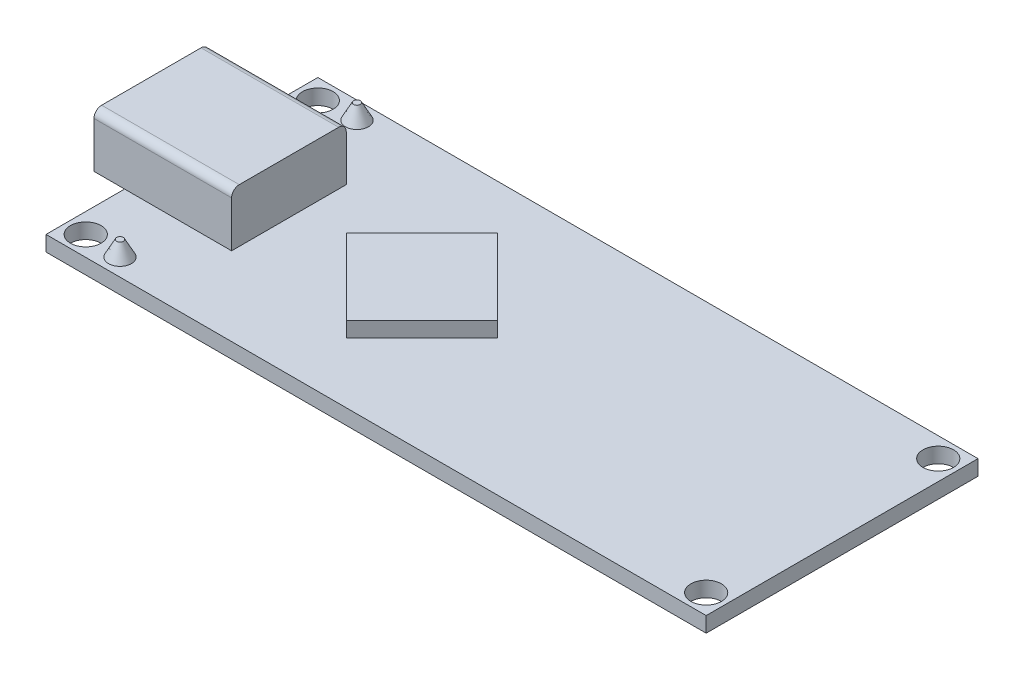
ISO-10303-21;
HEADER;
FILE_DESCRIPTION(('STEP AP214'),'2;1');
FILE_NAME('part.step','',(''),(''),'','','');
FILE_SCHEMA(('AUTOMOTIVE_DESIGN { 1 0 10303 214 1 1 1 1 }'));
ENDSEC;
DATA;
#1=APPLICATION_CONTEXT('core data for automotive mechanical design processes');
#2=APPLICATION_PROTOCOL_DEFINITION('international standard','automotive_design',2000,#1);
#3=PRODUCT_CONTEXT('',#1,'mechanical');
#4=PRODUCT('Part','Part','',(#3));
#5=PRODUCT_RELATED_PRODUCT_CATEGORY('part','',(#4));
#6=PRODUCT_DEFINITION_FORMATION('','',#4);
#7=PRODUCT_DEFINITION_CONTEXT('part definition',#1,'design');
#8=PRODUCT_DEFINITION('design','',#6,#7);
#9=PRODUCT_DEFINITION_SHAPE('','',#8);
#10=(LENGTH_UNIT() NAMED_UNIT(*) SI_UNIT(.MILLI.,.METRE.));
#11=(NAMED_UNIT(*) PLANE_ANGLE_UNIT() SI_UNIT($,.RADIAN.));
#12=(NAMED_UNIT(*) SI_UNIT($,.STERADIAN.) SOLID_ANGLE_UNIT());
#13=UNCERTAINTY_MEASURE_WITH_UNIT(LENGTH_MEASURE(1.E-05),#10,'distance_accuracy_value','');
#14=(GEOMETRIC_REPRESENTATION_CONTEXT(3) GLOBAL_UNCERTAINTY_ASSIGNED_CONTEXT((#13)) GLOBAL_UNIT_ASSIGNED_CONTEXT((#10,
#11,#12)) REPRESENTATION_CONTEXT('',''));
#15=CARTESIAN_POINT('',(0.,0.,0.));
#16=DIRECTION('',(0.,0.,1.));
#17=DIRECTION('',(1.,0.,0.));
#18=AXIS2_PLACEMENT_3D('',#15,#16,#17);
#19=CARTESIAN_POINT('',(0.,1.,0.));
#20=DIRECTION('',(0.,-1.,0.));
#21=DIRECTION('',(0.,0.,-1.));
#22=AXIS2_PLACEMENT_3D('',#19,#20,#21);
#23=PLANE('',#22);
#24=CARTESIAN_POINT('',(20.29,1.,-7.59));
#25=DIRECTION('',(0.,1.,0.));
#26=DIRECTION('',(0.,0.,1.));
#27=AXIS2_PLACEMENT_3D('',#24,#25,#26);
#28=CIRCLE('',#27,1.);
#29=CARTESIAN_POINT('',(20.29,1.,-6.59));
#30=VERTEX_POINT('',#29);
#31=EDGE_CURVE('E260',#30,#30,#28,.T.);
#32=ORIENTED_EDGE('',*,*,#31,.F.);
#33=EDGE_LOOP('',(#32));
#34=FACE_BOUND('',#33,.T.);
#35=CARTESIAN_POINT('',(20.29,1.,7.59));
#36=DIRECTION('',(0.,1.,0.));
#37=DIRECTION('',(0.,0.,1.));
#38=AXIS2_PLACEMENT_3D('',#35,#36,#37);
#39=CIRCLE('',#38,1.);
#40=CARTESIAN_POINT('',(20.29,1.,8.59));
#41=VERTEX_POINT('',#40);
#42=EDGE_CURVE('E270',#41,#41,#39,.T.);
#43=ORIENTED_EDGE('',*,*,#42,.F.);
#44=EDGE_LOOP('',(#43));
#45=FACE_BOUND('',#44,.T.);
#46=CARTESIAN_POINT('',(-20.29,1.,7.59));
#47=DIRECTION('',(0.,1.,0.));
#48=DIRECTION('',(0.,0.,1.));
#49=AXIS2_PLACEMENT_3D('',#46,#47,#48);
#50=CIRCLE('',#49,1.);
#51=CARTESIAN_POINT('',(-20.29,1.,8.59));
#52=VERTEX_POINT('',#51);
#53=EDGE_CURVE('E276',#52,#52,#50,.T.);
#54=ORIENTED_EDGE('',*,*,#53,.F.);
#55=EDGE_LOOP('',(#54));
#56=FACE_BOUND('',#55,.T.);
#57=CARTESIAN_POINT('',(-20.29,1.,-7.59));
#58=DIRECTION('',(0.,1.,0.));
#59=DIRECTION('',(0.,0.,1.));
#60=AXIS2_PLACEMENT_3D('',#57,#58,#59);
#61=CIRCLE('',#60,1.);
#62=CARTESIAN_POINT('',(-20.29,1.,-6.59));
#63=VERTEX_POINT('',#62);
#64=EDGE_CURVE('E282',#63,#63,#61,.T.);
#65=ORIENTED_EDGE('',*,*,#64,.F.);
#66=EDGE_LOOP('',(#65));
#67=FACE_BOUND('',#66,.T.);
#68=DIRECTION('',(0.707106781186547,0.,0.707106781186547));
#69=VECTOR('',#68,1.);
#70=CARTESIAN_POINT('',(-5.89000000000001,1.,4.94974746830583));
#71=LINE('',#70,#69);
#72=CARTESIAN_POINT('',(-10.8397474683058,1.,0.));
#73=VERTEX_POINT('',#72);
#74=CARTESIAN_POINT('',(-5.89000000000001,1.,4.94974746830583));
#75=VERTEX_POINT('',#74);
#76=EDGE_CURVE('E318',#73,#75,#71,.T.);
#77=ORIENTED_EDGE('',*,*,#76,.F.);
#78=DIRECTION('',(-0.707106781186547,0.,0.707106781186547));
#79=VECTOR('',#78,1.);
#80=CARTESIAN_POINT('',(-10.8397474683058,1.,0.));
#81=LINE('',#80,#79);
#82=CARTESIAN_POINT('',(-5.89000000000001,1.,-4.94974746830583));
#83=VERTEX_POINT('',#82);
#84=EDGE_CURVE('E323',#83,#73,#81,.T.);
#85=ORIENTED_EDGE('',*,*,#84,.F.);
#86=DIRECTION('',(-0.707106781186547,0.,-0.707106781186547));
#87=VECTOR('',#86,1.);
#88=CARTESIAN_POINT('',(-5.89000000000001,1.,-4.94974746830583));
#89=LINE('',#88,#87);
#90=CARTESIAN_POINT('',(-0.940252531694178,1.,0.));
#91=VERTEX_POINT('',#90);
#92=EDGE_CURVE('E335',#91,#83,#89,.T.);
#93=ORIENTED_EDGE('',*,*,#92,.F.);
#94=DIRECTION('',(0.707106781186547,0.,-0.707106781186547));
#95=VECTOR('',#94,1.);
#96=CARTESIAN_POINT('',(-0.940252531694177,1.,0.));
#97=LINE('',#96,#95);
#98=EDGE_CURVE('E332',#75,#91,#97,.T.);
#99=ORIENTED_EDGE('',*,*,#98,.F.);
#100=EDGE_LOOP('',(#77,#85,#93,#99));
#101=FACE_BOUND('',#100,.T.);
#102=CARTESIAN_POINT('',(-17.89,1.,-7.75));
#103=DIRECTION('',(0.,-1.,0.));
#104=DIRECTION('',(0.,0.,-1.));
#105=AXIS2_PLACEMENT_3D('',#102,#103,#104);
#106=CIRCLE('',#105,0.750000000000002);
#107=CARTESIAN_POINT('',(-17.89,1.,-8.5));
#108=VERTEX_POINT('',#107);
#109=EDGE_CURVE('E390',#108,#108,#106,.F.);
#110=ORIENTED_EDGE('',*,*,#109,.F.);
#111=EDGE_LOOP('',(#110));
#112=FACE_BOUND('',#111,.T.);
#113=CARTESIAN_POINT('',(-17.89,1.,7.75));
#114=DIRECTION('',(0.,-1.,0.));
#115=DIRECTION('',(0.,0.,-1.));
#116=AXIS2_PLACEMENT_3D('',#113,#114,#115);
#117=CIRCLE('',#116,0.750000000000002);
#118=CARTESIAN_POINT('',(-17.89,1.,7.));
#119=VERTEX_POINT('',#118);
#120=EDGE_CURVE('E393',#119,#119,#117,.F.);
#121=ORIENTED_EDGE('',*,*,#120,.F.);
#122=EDGE_LOOP('',(#121));
#123=FACE_BOUND('',#122,.T.);
#124=DIRECTION('',(-1.,0.,0.));
#125=VECTOR('',#124,1.);
#126=CARTESIAN_POINT('',(-14.59,1.,-3.75));
#127=LINE('',#126,#125);
#128=CARTESIAN_POINT('',(-14.59,1.,-3.75));
#129=VERTEX_POINT('',#128);
#130=CARTESIAN_POINT('',(-21.59,1.,-3.75));
#131=VERTEX_POINT('',#130);
#132=EDGE_CURVE('E302',#129,#131,#127,.T.);
#133=ORIENTED_EDGE('',*,*,#132,.F.);
#134=DIRECTION('',(0.,0.,-1.));
#135=VECTOR('',#134,1.);
#136=CARTESIAN_POINT('',(-14.59,1.,-3.75));
#137=LINE('',#136,#135);
#138=CARTESIAN_POINT('',(-14.59,1.,3.75));
#139=VERTEX_POINT('',#138);
#140=EDGE_CURVE('E288',#139,#129,#137,.T.);
#141=ORIENTED_EDGE('',*,*,#140,.F.);
#142=DIRECTION('',(1.,0.,0.));
#143=VECTOR('',#142,1.);
#144=CARTESIAN_POINT('',(-14.59,1.,3.75));
#145=LINE('',#144,#143);
#146=CARTESIAN_POINT('',(-21.59,1.,3.75));
#147=VERTEX_POINT('',#146);
#148=EDGE_CURVE('E308',#147,#139,#145,.T.);
#149=ORIENTED_EDGE('',*,*,#148,.F.);
#150=DIRECTION('',(0.,0.,1.));
#151=VECTOR('',#150,1.);
#152=CARTESIAN_POINT('',(-21.59,1.,8.89));
#153=LINE('',#152,#151);
#154=CARTESIAN_POINT('',(-21.59,1.,8.89));
#155=VERTEX_POINT('',#154);
#156=EDGE_CURVE('E364',#147,#155,#153,.T.);
#157=ORIENTED_EDGE('',*,*,#156,.T.);
#158=DIRECTION('',(1.,0.,0.));
#159=VECTOR('',#158,1.);
#160=CARTESIAN_POINT('',(-21.59,1.,8.89));
#161=LINE('',#160,#159);
#162=CARTESIAN_POINT('',(21.59,1.,8.89));
#163=VERTEX_POINT('',#162);
#164=EDGE_CURVE('E368',#155,#163,#161,.T.);
#165=ORIENTED_EDGE('',*,*,#164,.T.);
#166=DIRECTION('',(0.,0.,-1.));
#167=VECTOR('',#166,1.);
#168=CARTESIAN_POINT('',(21.59,1.,8.89));
#169=LINE('',#168,#167);
#170=CARTESIAN_POINT('',(21.59,1.,-8.89));
#171=VERTEX_POINT('',#170);
#172=EDGE_CURVE('E358',#163,#171,#169,.T.);
#173=ORIENTED_EDGE('',*,*,#172,.T.);
#174=DIRECTION('',(-1.,0.,0.));
#175=VECTOR('',#174,1.);
#176=CARTESIAN_POINT('',(-21.59,1.,-8.89));
#177=LINE('',#176,#175);
#178=CARTESIAN_POINT('',(-21.59,1.,-8.89));
#179=VERTEX_POINT('',#178);
#180=EDGE_CURVE('E361',#171,#179,#177,.T.);
#181=ORIENTED_EDGE('',*,*,#180,.T.);
#182=EDGE_CURVE('E365',#179,#131,#153,.T.);
#183=ORIENTED_EDGE('',*,*,#182,.T.);
#184=EDGE_LOOP('',(#133,#141,#149,#157,#165,#173,#181,#183));
#185=FACE_BOUND('',#184,.T.);
#186=ADVANCED_FACE('F35',(#34,#45,#56,#67,#101,#112,#123,#185),#23,.F.);
#187=CARTESIAN_POINT('',(21.59,1.,8.89));
#188=DIRECTION('',(-1.,0.,0.));
#189=DIRECTION('',(0.,0.,1.));
#190=AXIS2_PLACEMENT_3D('',#187,#188,#189);
#191=PLANE('',#190);
#192=DIRECTION('',(0.,0.,-1.));
#193=VECTOR('',#192,1.);
#194=CARTESIAN_POINT('',(21.59,0.,8.89));
#195=LINE('',#194,#193);
#196=CARTESIAN_POINT('',(21.59,0.,8.89));
#197=VERTEX_POINT('',#196);
#198=CARTESIAN_POINT('',(21.59,0.,-8.89));
#199=VERTEX_POINT('',#198);
#200=EDGE_CURVE('E357',#197,#199,#195,.T.);
#201=ORIENTED_EDGE('',*,*,#200,.T.);
#202=DIRECTION('',(0.,-1.,0.));
#203=VECTOR('',#202,1.);
#204=CARTESIAN_POINT('',(21.59,1.,-8.89));
#205=LINE('',#204,#203);
#206=EDGE_CURVE('E387',#171,#199,#205,.T.);
#207=ORIENTED_EDGE('',*,*,#206,.F.);
#208=ORIENTED_EDGE('',*,*,#172,.F.);
#209=DIRECTION('',(0.,-1.,0.));
#210=VECTOR('',#209,1.);
#211=CARTESIAN_POINT('',(21.59,1.,8.89));
#212=LINE('',#211,#210);
#213=EDGE_CURVE('E371',#163,#197,#212,.T.);
#214=ORIENTED_EDGE('',*,*,#213,.T.);
#215=EDGE_LOOP('',(#201,#207,#208,#214));
#216=FACE_BOUND('',#215,.T.);
#217=ADVANCED_FACE('F452',(#216),#191,.F.);
#218=CARTESIAN_POINT('',(-21.59,1.,-8.89));
#219=DIRECTION('',(0.,0.,1.));
#220=DIRECTION('',(1.,0.,0.));
#221=AXIS2_PLACEMENT_3D('',#218,#219,#220);
#222=PLANE('',#221);
#223=DIRECTION('',(-1.,0.,0.));
#224=VECTOR('',#223,1.);
#225=CARTESIAN_POINT('',(-21.59,0.,-8.89));
#226=LINE('',#225,#224);
#227=CARTESIAN_POINT('',(-21.59,0.,-8.89));
#228=VERTEX_POINT('',#227);
#229=EDGE_CURVE('E374',#199,#228,#226,.T.);
#230=ORIENTED_EDGE('',*,*,#229,.T.);
#231=DIRECTION('',(0.,-1.,0.));
#232=VECTOR('',#231,1.);
#233=CARTESIAN_POINT('',(-21.59,1.,-8.89));
#234=LINE('',#233,#232);
#235=EDGE_CURVE('E384',#179,#228,#234,.T.);
#236=ORIENTED_EDGE('',*,*,#235,.F.);
#237=ORIENTED_EDGE('',*,*,#180,.F.);
#238=ORIENTED_EDGE('',*,*,#206,.T.);
#239=EDGE_LOOP('',(#230,#236,#237,#238));
#240=FACE_BOUND('',#239,.T.);
#241=ADVANCED_FACE('F454',(#240),#222,.F.);
#242=CARTESIAN_POINT('',(-21.59,1.,8.89));
#243=DIRECTION('',(1.,0.,0.));
#244=DIRECTION('',(0.,0.,-1.));
#245=AXIS2_PLACEMENT_3D('',#242,#243,#244);
#246=PLANE('',#245);
#247=DIRECTION('',(0.,0.,1.));
#248=VECTOR('',#247,1.);
#249=CARTESIAN_POINT('',(-21.59,0.,8.89));
#250=LINE('',#249,#248);
#251=CARTESIAN_POINT('',(-21.59,0.,8.89));
#252=VERTEX_POINT('',#251);
#253=EDGE_CURVE('E376',#228,#252,#250,.T.);
#254=ORIENTED_EDGE('',*,*,#253,.T.);
#255=DIRECTION('',(0.,-1.,0.));
#256=VECTOR('',#255,1.);
#257=CARTESIAN_POINT('',(-21.59,1.,8.89));
#258=LINE('',#257,#256);
#259=EDGE_CURVE('E381',#155,#252,#258,.T.);
#260=ORIENTED_EDGE('',*,*,#259,.F.);
#261=ORIENTED_EDGE('',*,*,#156,.F.);
#262=EDGE_CURVE('E369',#131,#147,#153,.T.);
#263=ORIENTED_EDGE('',*,*,#262,.F.);
#264=ORIENTED_EDGE('',*,*,#182,.F.);
#265=ORIENTED_EDGE('',*,*,#235,.T.);
#266=EDGE_LOOP('',(#254,#260,#261,#263,#264,#265));
#267=FACE_BOUND('',#266,.T.);
#268=ADVANCED_FACE('F440',(#267),#246,.F.);
#269=CARTESIAN_POINT('',(-21.59,1.,8.89));
#270=DIRECTION('',(0.,0.,-1.));
#271=DIRECTION('',(-1.,0.,0.));
#272=AXIS2_PLACEMENT_3D('',#269,#270,#271);
#273=PLANE('',#272);
#274=DIRECTION('',(1.,0.,0.));
#275=VECTOR('',#274,1.);
#276=CARTESIAN_POINT('',(-21.59,0.,8.89));
#277=LINE('',#276,#275);
#278=EDGE_CURVE('E362',#252,#197,#277,.T.);
#279=ORIENTED_EDGE('',*,*,#278,.T.);
#280=ORIENTED_EDGE('',*,*,#213,.F.);
#281=ORIENTED_EDGE('',*,*,#164,.F.);
#282=ORIENTED_EDGE('',*,*,#259,.T.);
#283=EDGE_LOOP('',(#279,#280,#281,#282));
#284=FACE_BOUND('',#283,.T.);
#285=ADVANCED_FACE('F447',(#284),#273,.F.);
#286=CARTESIAN_POINT('',(0.,0.,0.));
#287=DIRECTION('',(0.,-1.,0.));
#288=DIRECTION('',(0.,0.,-1.));
#289=AXIS2_PLACEMENT_3D('',#286,#287,#288);
#290=PLANE('',#289);
#291=CARTESIAN_POINT('',(20.29,0.,-7.59));
#292=DIRECTION('',(0.,1.,0.));
#293=DIRECTION('',(0.,0.,1.));
#294=AXIS2_PLACEMENT_3D('',#291,#292,#293);
#295=CIRCLE('',#294,1.);
#296=CARTESIAN_POINT('',(20.29,0.,-6.59));
#297=VERTEX_POINT('',#296);
#298=EDGE_CURVE('E267',#297,#297,#295,.T.);
#299=ORIENTED_EDGE('',*,*,#298,.T.);
#300=EDGE_LOOP('',(#299));
#301=FACE_BOUND('',#300,.T.);
#302=CARTESIAN_POINT('',(20.29,0.,7.59));
#303=DIRECTION('',(0.,1.,0.));
#304=DIRECTION('',(0.,0.,1.));
#305=AXIS2_PLACEMENT_3D('',#302,#303,#304);
#306=CIRCLE('',#305,1.);
#307=CARTESIAN_POINT('',(20.29,0.,8.59));
#308=VERTEX_POINT('',#307);
#309=EDGE_CURVE('E273',#308,#308,#306,.T.);
#310=ORIENTED_EDGE('',*,*,#309,.T.);
#311=EDGE_LOOP('',(#310));
#312=FACE_BOUND('',#311,.T.);
#313=CARTESIAN_POINT('',(-20.29,0.,7.59));
#314=DIRECTION('',(0.,1.,0.));
#315=DIRECTION('',(0.,0.,1.));
#316=AXIS2_PLACEMENT_3D('',#313,#314,#315);
#317=CIRCLE('',#316,1.);
#318=CARTESIAN_POINT('',(-20.29,0.,8.59));
#319=VERTEX_POINT('',#318);
#320=EDGE_CURVE('E279',#319,#319,#317,.T.);
#321=ORIENTED_EDGE('',*,*,#320,.T.);
#322=EDGE_LOOP('',(#321));
#323=FACE_BOUND('',#322,.T.);
#324=CARTESIAN_POINT('',(-20.29,0.,-7.59));
#325=DIRECTION('',(0.,1.,0.));
#326=DIRECTION('',(0.,0.,1.));
#327=AXIS2_PLACEMENT_3D('',#324,#325,#326);
#328=CIRCLE('',#327,1.);
#329=CARTESIAN_POINT('',(-20.29,0.,-6.59));
#330=VERTEX_POINT('',#329);
#331=EDGE_CURVE('E285',#330,#330,#328,.T.);
#332=ORIENTED_EDGE('',*,*,#331,.T.);
#333=EDGE_LOOP('',(#332));
#334=FACE_BOUND('',#333,.T.);
#335=ORIENTED_EDGE('',*,*,#200,.F.);
#336=ORIENTED_EDGE('',*,*,#278,.F.);
#337=ORIENTED_EDGE('',*,*,#253,.F.);
#338=ORIENTED_EDGE('',*,*,#229,.F.);
#339=EDGE_LOOP('',(#335,#336,#337,#338));
#340=FACE_BOUND('',#339,.T.);
#341=ADVANCED_FACE('F456',(#301,#312,#323,#334,#340),#290,.T.);
#342=CARTESIAN_POINT('',(-17.89,1.,-7.75));
#343=DIRECTION('',(0.,-1.,0.));
#344=DIRECTION('',(0.,0.,1.));
#345=AXIS2_PLACEMENT_3D('',#342,#343,#344);
#346=CONICAL_SURFACE('',#345,0.750000000000002,0.488692190558413);
#347=CARTESIAN_POINT('',(-17.89,2.,-7.75));
#348=DIRECTION('',(0.,1.,0.));
#349=DIRECTION('',(0.,0.,1.));
#350=AXIS2_PLACEMENT_3D('',#347,#348,#349);
#351=CIRCLE('',#350,0.218290568338523);
#352=CARTESIAN_POINT('',(-17.89,2.,-7.53170943166148));
#353=VERTEX_POINT('',#352);
#354=EDGE_CURVE('E354',#353,#353,#351,.T.);
#355=ORIENTED_EDGE('',*,*,#354,.F.);
#356=EDGE_LOOP('',(#355));
#357=FACE_BOUND('',#356,.T.);
#358=ORIENTED_EDGE('',*,*,#109,.T.);
#359=EDGE_LOOP('',(#358));
#360=FACE_BOUND('',#359,.T.);
#361=ADVANCED_FACE('F458',(#357,#360),#346,.T.);
#362=CARTESIAN_POINT('',(-17.89,2.,-7.75));
#363=DIRECTION('',(0.,1.,0.));
#364=DIRECTION('',(0.,0.,1.));
#365=AXIS2_PLACEMENT_3D('',#362,#363,#364);
#366=PLANE('',#365);
#367=ORIENTED_EDGE('',*,*,#354,.T.);
#368=EDGE_LOOP('',(#367));
#369=FACE_BOUND('',#368,.T.);
#370=ADVANCED_FACE('F465',(#369),#366,.T.);
#371=CARTESIAN_POINT('',(-17.89,1.,7.75));
#372=DIRECTION('',(0.,-1.,0.));
#373=DIRECTION('',(0.,0.,1.));
#374=AXIS2_PLACEMENT_3D('',#371,#372,#373);
#375=CONICAL_SURFACE('',#374,0.750000000000002,0.488692190558413);
#376=CARTESIAN_POINT('',(-17.89,2.,7.75));
#377=DIRECTION('',(0.,1.,0.));
#378=DIRECTION('',(0.,0.,1.));
#379=AXIS2_PLACEMENT_3D('',#376,#377,#378);
#380=CIRCLE('',#379,0.218290568338523);
#381=CARTESIAN_POINT('',(-17.89,2.,7.96829056833853));
#382=VERTEX_POINT('',#381);
#383=EDGE_CURVE('E351',#382,#382,#380,.T.);
#384=ORIENTED_EDGE('',*,*,#383,.F.);
#385=EDGE_LOOP('',(#384));
#386=FACE_BOUND('',#385,.T.);
#387=ORIENTED_EDGE('',*,*,#120,.T.);
#388=EDGE_LOOP('',(#387));
#389=FACE_BOUND('',#388,.T.);
#390=ADVANCED_FACE('F482',(#386,#389),#375,.T.);
#391=CARTESIAN_POINT('',(-17.89,2.,7.75));
#392=DIRECTION('',(0.,1.,0.));
#393=DIRECTION('',(0.,0.,1.));
#394=AXIS2_PLACEMENT_3D('',#391,#392,#393);
#395=PLANE('',#394);
#396=ORIENTED_EDGE('',*,*,#383,.T.);
#397=EDGE_LOOP('',(#396));
#398=FACE_BOUND('',#397,.T.);
#399=ADVANCED_FACE('F486',(#398),#395,.T.);
#400=CARTESIAN_POINT('',(-5.89000000000001,2.,4.94974746830583));
#401=DIRECTION('',(0.707106781186547,0.,-0.707106781186547));
#402=DIRECTION('',(-0.707106781186548,0.,-0.707106781186548));
#403=AXIS2_PLACEMENT_3D('',#400,#401,#402);
#404=PLANE('',#403);
#405=ORIENTED_EDGE('',*,*,#76,.T.);
#406=DIRECTION('',(0.,-1.,0.));
#407=VECTOR('',#406,1.);
#408=CARTESIAN_POINT('',(-5.89000000000001,2.,4.94974746830583));
#409=LINE('',#408,#407);
#410=CARTESIAN_POINT('',(-5.89000000000001,2.,4.94974746830583));
#411=VERTEX_POINT('',#410);
#412=EDGE_CURVE('E348',#411,#75,#409,.T.);
#413=ORIENTED_EDGE('',*,*,#412,.F.);
#414=DIRECTION('',(0.707106781186547,0.,0.707106781186547));
#415=VECTOR('',#414,1.);
#416=CARTESIAN_POINT('',(-5.89000000000001,2.,4.94974746830583));
#417=LINE('',#416,#415);
#418=CARTESIAN_POINT('',(-10.8397474683058,2.,0.));
#419=VERTEX_POINT('',#418);
#420=EDGE_CURVE('E319',#419,#411,#417,.T.);
#421=ORIENTED_EDGE('',*,*,#420,.F.);
#422=DIRECTION('',(0.,-1.,0.));
#423=VECTOR('',#422,1.);
#424=CARTESIAN_POINT('',(-10.8397474683058,2.,0.));
#425=LINE('',#424,#423);
#426=EDGE_CURVE('E329',#419,#73,#425,.T.);
#427=ORIENTED_EDGE('',*,*,#426,.T.);
#428=EDGE_LOOP('',(#405,#413,#421,#427));
#429=FACE_BOUND('',#428,.T.);
#430=ADVANCED_FACE('F490',(#429),#404,.F.);
#431=CARTESIAN_POINT('',(-0.940252531694177,2.,0.));
#432=DIRECTION('',(-0.707106781186547,0.,-0.707106781186547));
#433=DIRECTION('',(-0.707106781186548,0.,0.707106781186548));
#434=AXIS2_PLACEMENT_3D('',#431,#432,#433);
#435=PLANE('',#434);
#436=ORIENTED_EDGE('',*,*,#98,.T.);
#437=DIRECTION('',(0.,-1.,0.));
#438=VECTOR('',#437,1.);
#439=CARTESIAN_POINT('',(-0.940252531694177,2.,0.));
#440=LINE('',#439,#438);
#441=CARTESIAN_POINT('',(-0.940252531694177,2.,0.));
#442=VERTEX_POINT('',#441);
#443=EDGE_CURVE('E345',#442,#91,#440,.T.);
#444=ORIENTED_EDGE('',*,*,#443,.F.);
#445=DIRECTION('',(0.707106781186547,0.,-0.707106781186547));
#446=VECTOR('',#445,1.);
#447=CARTESIAN_POINT('',(-0.940252531694177,2.,0.));
#448=LINE('',#447,#446);
#449=EDGE_CURVE('E322',#411,#442,#448,.T.);
#450=ORIENTED_EDGE('',*,*,#449,.F.);
#451=ORIENTED_EDGE('',*,*,#412,.T.);
#452=EDGE_LOOP('',(#436,#444,#450,#451));
#453=FACE_BOUND('',#452,.T.);
#454=ADVANCED_FACE('F494',(#453),#435,.F.);
#455=CARTESIAN_POINT('',(-5.89000000000001,2.,-4.94974746830583));
#456=DIRECTION('',(-0.707106781186547,0.,0.707106781186547));
#457=DIRECTION('',(0.707106781186548,0.,0.707106781186548));
#458=AXIS2_PLACEMENT_3D('',#455,#456,#457);
#459=PLANE('',#458);
#460=ORIENTED_EDGE('',*,*,#92,.T.);
#461=DIRECTION('',(0.,-1.,0.));
#462=VECTOR('',#461,1.);
#463=CARTESIAN_POINT('',(-5.89000000000001,2.,-4.94974746830583));
#464=LINE('',#463,#462);
#465=CARTESIAN_POINT('',(-5.89000000000001,2.,-4.94974746830583));
#466=VERTEX_POINT('',#465);
#467=EDGE_CURVE('E342',#466,#83,#464,.T.);
#468=ORIENTED_EDGE('',*,*,#467,.F.);
#469=DIRECTION('',(-0.707106781186547,0.,-0.707106781186547));
#470=VECTOR('',#469,1.);
#471=CARTESIAN_POINT('',(-5.89000000000001,2.,-4.94974746830583));
#472=LINE('',#471,#470);
#473=EDGE_CURVE('E325',#442,#466,#472,.T.);
#474=ORIENTED_EDGE('',*,*,#473,.F.);
#475=ORIENTED_EDGE('',*,*,#443,.T.);
#476=EDGE_LOOP('',(#460,#468,#474,#475));
#477=FACE_BOUND('',#476,.T.);
#478=ADVANCED_FACE('F498',(#477),#459,.F.);
#479=CARTESIAN_POINT('',(-10.8397474683058,2.,0.));
#480=DIRECTION('',(0.707106781186547,0.,0.707106781186547));
#481=DIRECTION('',(0.707106781186548,0.,-0.707106781186548));
#482=AXIS2_PLACEMENT_3D('',#479,#480,#481);
#483=PLANE('',#482);
#484=ORIENTED_EDGE('',*,*,#84,.T.);
#485=ORIENTED_EDGE('',*,*,#426,.F.);
#486=DIRECTION('',(-0.707106781186547,0.,0.707106781186547));
#487=VECTOR('',#486,1.);
#488=CARTESIAN_POINT('',(-10.8397474683058,2.,0.));
#489=LINE('',#488,#487);
#490=EDGE_CURVE('E327',#466,#419,#489,.T.);
#491=ORIENTED_EDGE('',*,*,#490,.F.);
#492=ORIENTED_EDGE('',*,*,#467,.T.);
#493=EDGE_LOOP('',(#484,#485,#491,#492));
#494=FACE_BOUND('',#493,.T.);
#495=ADVANCED_FACE('F502',(#494),#483,.F.);
#496=CARTESIAN_POINT('',(0.,2.,0.));
#497=DIRECTION('',(0.,-1.,0.));
#498=DIRECTION('',(0.,0.,-1.));
#499=AXIS2_PLACEMENT_3D('',#496,#497,#498);
#500=PLANE('',#499);
#501=ORIENTED_EDGE('',*,*,#420,.T.);
#502=ORIENTED_EDGE('',*,*,#449,.T.);
#503=ORIENTED_EDGE('',*,*,#473,.T.);
#504=ORIENTED_EDGE('',*,*,#490,.T.);
#505=EDGE_LOOP('',(#501,#502,#503,#504));
#506=FACE_BOUND('',#505,.T.);
#507=ADVANCED_FACE('F506',(#506),#500,.F.);
#508=CARTESIAN_POINT('',(0.,1.,0.));
#509=DIRECTION('',(0.,-1.,0.));
#510=DIRECTION('',(0.,0.,-1.));
#511=AXIS2_PLACEMENT_3D('',#508,#509,#510);
#512=PLANE('',#511);
#513=ORIENTED_EDGE('',*,*,#262,.T.);
#514=CARTESIAN_POINT('',(-23.59,1.,3.75));
#515=VERTEX_POINT('',#514);
#516=EDGE_CURVE('E295',#515,#147,#145,.T.);
#517=ORIENTED_EDGE('',*,*,#516,.F.);
#518=DIRECTION('',(0.,0.,1.));
#519=VECTOR('',#518,1.);
#520=CARTESIAN_POINT('',(-23.59,1.,-3.75));
#521=LINE('',#520,#519);
#522=CARTESIAN_POINT('',(-23.59,1.,-3.75));
#523=VERTEX_POINT('',#522);
#524=EDGE_CURVE('E305',#523,#515,#521,.T.);
#525=ORIENTED_EDGE('',*,*,#524,.F.);
#526=EDGE_CURVE('E301',#131,#523,#127,.T.);
#527=ORIENTED_EDGE('',*,*,#526,.F.);
#528=EDGE_LOOP('',(#513,#517,#525,#527));
#529=FACE_BOUND('',#528,.T.);
#530=ADVANCED_FACE('F426',(#529),#512,.T.);
#531=CARTESIAN_POINT('',(-14.59,4.5,-3.75));
#532=DIRECTION('',(-1.,0.,0.));
#533=DIRECTION('',(0.,0.,1.));
#534=AXIS2_PLACEMENT_3D('',#531,#532,#533);
#535=PLANE('',#534);
#536=DIRECTION('',(0.,-1.,0.));
#537=VECTOR('',#536,1.);
#538=CARTESIAN_POINT('',(-14.59,4.5,-3.75));
#539=LINE('',#538,#537);
#540=CARTESIAN_POINT('',(-14.59,4.,-3.75));
#541=VERTEX_POINT('',#540);
#542=EDGE_CURVE('E316',#541,#129,#539,.T.);
#543=ORIENTED_EDGE('',*,*,#542,.F.);
#544=CARTESIAN_POINT('',(-14.59,4.,-3.25));
#545=DIRECTION('',(-1.,0.,0.));
#546=DIRECTION('',(0.,0.,1.));
#547=AXIS2_PLACEMENT_3D('',#544,#545,#546);
#548=CIRCLE('',#547,0.5);
#549=CARTESIAN_POINT('',(-14.59,4.5,-3.25));
#550=VERTEX_POINT('',#549);
#551=EDGE_CURVE('E43',#541,#550,#548,.F.);
#552=ORIENTED_EDGE('',*,*,#551,.T.);
#553=DIRECTION('',(0.,0.,-1.));
#554=VECTOR('',#553,1.);
#555=CARTESIAN_POINT('',(-14.59,4.5,-3.75));
#556=LINE('',#555,#554);
#557=CARTESIAN_POINT('',(-14.59,4.5,3.25));
#558=VERTEX_POINT('',#557);
#559=EDGE_CURVE('E291',#558,#550,#556,.T.);
#560=ORIENTED_EDGE('',*,*,#559,.F.);
#561=CARTESIAN_POINT('',(-14.59,4.,3.25));
#562=DIRECTION('',(-1.,0.,0.));
#563=DIRECTION('',(0.,0.,1.));
#564=AXIS2_PLACEMENT_3D('',#561,#562,#563);
#565=CIRCLE('',#564,0.5);
#566=CARTESIAN_POINT('',(-14.59,4.,3.75));
#567=VERTEX_POINT('',#566);
#568=EDGE_CURVE('E50',#558,#567,#565,.F.);
#569=ORIENTED_EDGE('',*,*,#568,.T.);
#570=DIRECTION('',(0.,-1.,0.));
#571=VECTOR('',#570,1.);
#572=CARTESIAN_POINT('',(-14.59,4.5,3.75));
#573=LINE('',#572,#571);
#574=EDGE_CURVE('E298',#567,#139,#573,.T.);
#575=ORIENTED_EDGE('',*,*,#574,.T.);
#576=ORIENTED_EDGE('',*,*,#140,.T.);
#577=EDGE_LOOP('',(#543,#552,#560,#569,#575,#576));
#578=FACE_BOUND('',#577,.T.);
#579=ADVANCED_FACE('F408',(#578),#535,.F.);
#580=CARTESIAN_POINT('',(-14.59,4.5,-3.75));
#581=DIRECTION('',(0.,0.,1.));
#582=DIRECTION('',(1.,0.,0.));
#583=AXIS2_PLACEMENT_3D('',#580,#581,#582);
#584=PLANE('',#583);
#585=DIRECTION('',(0.,-1.,0.));
#586=VECTOR('',#585,1.);
#587=CARTESIAN_POINT('',(-23.59,4.5,-3.75));
#588=LINE('',#587,#586);
#589=CARTESIAN_POINT('',(-23.59,4.,-3.75));
#590=VERTEX_POINT('',#589);
#591=EDGE_CURVE('E314',#590,#523,#588,.T.);
#592=ORIENTED_EDGE('',*,*,#591,.F.);
#593=DIRECTION('',(-1.,0.,0.));
#594=VECTOR('',#593,1.);
#595=CARTESIAN_POINT('',(-14.59,4.,-3.75));
#596=LINE('',#595,#594);
#597=EDGE_CURVE('E58',#590,#541,#596,.F.);
#598=ORIENTED_EDGE('',*,*,#597,.T.);
#599=ORIENTED_EDGE('',*,*,#542,.T.);
#600=ORIENTED_EDGE('',*,*,#132,.T.);
#601=ORIENTED_EDGE('',*,*,#526,.T.);
#602=EDGE_LOOP('',(#592,#598,#599,#600,#601));
#603=FACE_BOUND('',#602,.T.);
#604=ADVANCED_FACE('F419',(#603),#584,.F.);
#605=CARTESIAN_POINT('',(-23.59,4.5,-3.75));
#606=DIRECTION('',(1.,0.,0.));
#607=DIRECTION('',(0.,0.,-1.));
#608=AXIS2_PLACEMENT_3D('',#605,#606,#607);
#609=PLANE('',#608);
#610=DIRECTION('',(0.,0.,-1.));
#611=VECTOR('',#610,1.);
#612=CARTESIAN_POINT('',(-23.59,4.,-3.25));
#613=LINE('',#612,#611);
#614=CARTESIAN_POINT('',(-23.59,4.,3.25));
#615=VERTEX_POINT('',#614);
#616=CARTESIAN_POINT('',(-23.59,4.,-3.25));
#617=VERTEX_POINT('',#616);
#618=EDGE_CURVE('E250',#615,#617,#613,.T.);
#619=ORIENTED_EDGE('',*,*,#618,.F.);
#620=DIRECTION('',(0.,1.,0.));
#621=VECTOR('',#620,1.);
#622=CARTESIAN_POINT('',(-23.59,1.5,3.25));
#623=LINE('',#622,#621);
#624=CARTESIAN_POINT('',(-23.59,1.5,3.25));
#625=VERTEX_POINT('',#624);
#626=EDGE_CURVE('E231',#625,#615,#623,.T.);
#627=ORIENTED_EDGE('',*,*,#626,.F.);
#628=DIRECTION('',(0.,0.,1.));
#629=VECTOR('',#628,1.);
#630=CARTESIAN_POINT('',(-23.59,1.5,-3.25));
#631=LINE('',#630,#629);
#632=CARTESIAN_POINT('',(-23.59,1.5,-3.25));
#633=VERTEX_POINT('',#632);
#634=EDGE_CURVE('E239',#633,#625,#631,.T.);
#635=ORIENTED_EDGE('',*,*,#634,.F.);
#636=DIRECTION('',(0.,-1.,0.));
#637=VECTOR('',#636,1.);
#638=CARTESIAN_POINT('',(-23.59,1.5,-3.25));
#639=LINE('',#638,#637);
#640=EDGE_CURVE('E253',#617,#633,#639,.T.);
#641=ORIENTED_EDGE('',*,*,#640,.F.);
#642=EDGE_LOOP('',(#619,#627,#635,#641));
#643=FACE_BOUND('',#642,.T.);
#644=DIRECTION('',(0.,0.,1.));
#645=VECTOR('',#644,1.);
#646=CARTESIAN_POINT('',(-23.59,4.5,-3.75));
#647=LINE('',#646,#645);
#648=CARTESIAN_POINT('',(-23.59,4.5,-3.25));
#649=VERTEX_POINT('',#648);
#650=CARTESIAN_POINT('',(-23.59,4.5,3.25));
#651=VERTEX_POINT('',#650);
#652=EDGE_CURVE('E294',#649,#651,#647,.T.);
#653=ORIENTED_EDGE('',*,*,#652,.F.);
#654=CARTESIAN_POINT('',(-23.59,4.,-3.25));
#655=DIRECTION('',(1.,0.,0.));
#656=DIRECTION('',(0.,0.,-1.));
#657=AXIS2_PLACEMENT_3D('',#654,#655,#656);
#658=CIRCLE('',#657,0.5);
#659=EDGE_CURVE('E404',#649,#590,#658,.F.);
#660=ORIENTED_EDGE('',*,*,#659,.T.);
#661=ORIENTED_EDGE('',*,*,#591,.T.);
#662=ORIENTED_EDGE('',*,*,#524,.T.);
#663=DIRECTION('',(0.,-1.,0.));
#664=VECTOR('',#663,1.);
#665=CARTESIAN_POINT('',(-23.59,4.5,3.75));
#666=LINE('',#665,#664);
#667=CARTESIAN_POINT('',(-23.59,4.,3.75));
#668=VERTEX_POINT('',#667);
#669=EDGE_CURVE('E312',#668,#515,#666,.T.);
#670=ORIENTED_EDGE('',*,*,#669,.F.);
#671=CARTESIAN_POINT('',(-23.59,4.,3.25));
#672=DIRECTION('',(1.,0.,0.));
#673=DIRECTION('',(0.,0.,-1.));
#674=AXIS2_PLACEMENT_3D('',#671,#672,#673);
#675=CIRCLE('',#674,0.5);
#676=EDGE_CURVE('E402',#668,#651,#675,.F.);
#677=ORIENTED_EDGE('',*,*,#676,.T.);
#678=EDGE_LOOP('',(#653,#660,#661,#662,#670,#677));
#679=FACE_BOUND('',#678,.T.);
#680=ADVANCED_FACE('F417',(#643,#679),#609,.F.);
#681=CARTESIAN_POINT('',(-14.59,4.5,3.75));
#682=DIRECTION('',(0.,0.,-1.));
#683=DIRECTION('',(-1.,0.,0.));
#684=AXIS2_PLACEMENT_3D('',#681,#682,#683);
#685=PLANE('',#684);
#686=ORIENTED_EDGE('',*,*,#574,.F.);
#687=DIRECTION('',(1.,0.,0.));
#688=VECTOR('',#687,1.);
#689=CARTESIAN_POINT('',(-14.59,4.,3.75));
#690=LINE('',#689,#688);
#691=EDGE_CURVE('E11',#567,#668,#690,.F.);
#692=ORIENTED_EDGE('',*,*,#691,.T.);
#693=ORIENTED_EDGE('',*,*,#669,.T.);
#694=ORIENTED_EDGE('',*,*,#516,.T.);
#695=ORIENTED_EDGE('',*,*,#148,.T.);
#696=EDGE_LOOP('',(#686,#692,#693,#694,#695));
#697=FACE_BOUND('',#696,.T.);
#698=ADVANCED_FACE('F432',(#697),#685,.F.);
#699=CARTESIAN_POINT('',(0.,4.5,0.));
#700=DIRECTION('',(0.,-1.,0.));
#701=DIRECTION('',(0.,0.,-1.));
#702=AXIS2_PLACEMENT_3D('',#699,#700,#701);
#703=PLANE('',#702);
#704=ORIENTED_EDGE('',*,*,#559,.T.);
#705=DIRECTION('',(-1.,0.,0.));
#706=VECTOR('',#705,1.);
#707=CARTESIAN_POINT('',(0.,4.5,-3.24999999999999));
#708=LINE('',#707,#706);
#709=EDGE_CURVE('E399',#550,#649,#708,.T.);
#710=ORIENTED_EDGE('',*,*,#709,.T.);
#711=ORIENTED_EDGE('',*,*,#652,.T.);
#712=DIRECTION('',(1.,0.,0.));
#713=VECTOR('',#712,1.);
#714=CARTESIAN_POINT('',(0.,4.5,3.25));
#715=LINE('',#714,#713);
#716=EDGE_CURVE('E396',#651,#558,#715,.T.);
#717=ORIENTED_EDGE('',*,*,#716,.T.);
#718=EDGE_LOOP('',(#704,#710,#711,#717));
#719=FACE_BOUND('',#718,.T.);
#720=ADVANCED_FACE('F412',(#719),#703,.F.);
#721=CARTESIAN_POINT('',(-20.29,0.,-7.59));
#722=DIRECTION('',(0.,1.,0.));
#723=DIRECTION('',(0.,0.,1.));
#724=AXIS2_PLACEMENT_3D('',#721,#722,#723);
#725=CYLINDRICAL_SURFACE('',#724,1.);
#726=ORIENTED_EDGE('',*,*,#331,.F.);
#727=EDGE_LOOP('',(#726));
#728=FACE_BOUND('',#727,.T.);
#729=ORIENTED_EDGE('',*,*,#64,.T.);
#730=EDGE_LOOP('',(#729));
#731=FACE_BOUND('',#730,.T.);
#732=ADVANCED_FACE('F525',(#728,#731),#725,.F.);
#733=CARTESIAN_POINT('',(-20.29,0.,7.59));
#734=DIRECTION('',(0.,1.,0.));
#735=DIRECTION('',(0.,0.,1.));
#736=AXIS2_PLACEMENT_3D('',#733,#734,#735);
#737=CYLINDRICAL_SURFACE('',#736,1.);
#738=ORIENTED_EDGE('',*,*,#320,.F.);
#739=EDGE_LOOP('',(#738));
#740=FACE_BOUND('',#739,.T.);
#741=ORIENTED_EDGE('',*,*,#53,.T.);
#742=EDGE_LOOP('',(#741));
#743=FACE_BOUND('',#742,.T.);
#744=ADVANCED_FACE('F528',(#740,#743),#737,.F.);
#745=CARTESIAN_POINT('',(20.29,0.,7.59));
#746=DIRECTION('',(0.,1.,0.));
#747=DIRECTION('',(0.,0.,1.));
#748=AXIS2_PLACEMENT_3D('',#745,#746,#747);
#749=CYLINDRICAL_SURFACE('',#748,1.);
#750=ORIENTED_EDGE('',*,*,#309,.F.);
#751=EDGE_LOOP('',(#750));
#752=FACE_BOUND('',#751,.T.);
#753=ORIENTED_EDGE('',*,*,#42,.T.);
#754=EDGE_LOOP('',(#753));
#755=FACE_BOUND('',#754,.T.);
#756=ADVANCED_FACE('F532',(#752,#755),#749,.F.);
#757=CARTESIAN_POINT('',(20.29,0.,-7.59));
#758=DIRECTION('',(0.,1.,0.));
#759=DIRECTION('',(0.,0.,1.));
#760=AXIS2_PLACEMENT_3D('',#757,#758,#759);
#761=CYLINDRICAL_SURFACE('',#760,1.);
#762=ORIENTED_EDGE('',*,*,#298,.F.);
#763=EDGE_LOOP('',(#762));
#764=FACE_BOUND('',#763,.T.);
#765=ORIENTED_EDGE('',*,*,#31,.T.);
#766=EDGE_LOOP('',(#765));
#767=FACE_BOUND('',#766,.T.);
#768=ADVANCED_FACE('F536',(#764,#767),#761,.F.);
#769=CARTESIAN_POINT('',(-16.59,1.5,3.25));
#770=DIRECTION('',(0.,0.,1.));
#771=DIRECTION('',(1.,0.,0.));
#772=AXIS2_PLACEMENT_3D('',#769,#770,#771);
#773=PLANE('',#772);
#774=ORIENTED_EDGE('',*,*,#626,.T.);
#775=DIRECTION('',(-1.,0.,0.));
#776=VECTOR('',#775,1.);
#777=CARTESIAN_POINT('',(-16.59,4.,3.25));
#778=LINE('',#777,#776);
#779=CARTESIAN_POINT('',(-16.59,4.,3.25));
#780=VERTEX_POINT('',#779);
#781=EDGE_CURVE('E248',#780,#615,#778,.T.);
#782=ORIENTED_EDGE('',*,*,#781,.F.);
#783=DIRECTION('',(0.,1.,0.));
#784=VECTOR('',#783,1.);
#785=CARTESIAN_POINT('',(-16.59,1.5,3.25));
#786=LINE('',#785,#784);
#787=CARTESIAN_POINT('',(-16.59,1.5,3.25));
#788=VERTEX_POINT('',#787);
#789=EDGE_CURVE('E235',#788,#780,#786,.T.);
#790=ORIENTED_EDGE('',*,*,#789,.F.);
#791=DIRECTION('',(-1.,0.,0.));
#792=VECTOR('',#791,1.);
#793=CARTESIAN_POINT('',(-16.59,1.5,3.25));
#794=LINE('',#793,#792);
#795=EDGE_CURVE('E258',#788,#625,#794,.T.);
#796=ORIENTED_EDGE('',*,*,#795,.T.);
#797=EDGE_LOOP('',(#774,#782,#790,#796));
#798=FACE_BOUND('',#797,.T.);
#799=ADVANCED_FACE('F540',(#798),#773,.F.);
#800=CARTESIAN_POINT('',(-16.59,1.5,-3.25));
#801=DIRECTION('',(0.,-1.,0.));
#802=DIRECTION('',(0.,0.,-1.));
#803=AXIS2_PLACEMENT_3D('',#800,#801,#802);
#804=PLANE('',#803);
#805=ORIENTED_EDGE('',*,*,#634,.T.);
#806=ORIENTED_EDGE('',*,*,#795,.F.);
#807=DIRECTION('',(0.,0.,1.));
#808=VECTOR('',#807,1.);
#809=CARTESIAN_POINT('',(-16.59,1.5,-3.25));
#810=LINE('',#809,#808);
#811=CARTESIAN_POINT('',(-16.59,1.5,-3.25));
#812=VERTEX_POINT('',#811);
#813=EDGE_CURVE('E245',#812,#788,#810,.T.);
#814=ORIENTED_EDGE('',*,*,#813,.F.);
#815=DIRECTION('',(-1.,0.,0.));
#816=VECTOR('',#815,1.);
#817=CARTESIAN_POINT('',(-16.59,1.5,-3.25));
#818=LINE('',#817,#816);
#819=EDGE_CURVE('E261',#812,#633,#818,.T.);
#820=ORIENTED_EDGE('',*,*,#819,.T.);
#821=EDGE_LOOP('',(#805,#806,#814,#820));
#822=FACE_BOUND('',#821,.T.);
#823=ADVANCED_FACE('F544',(#822),#804,.F.);
#824=CARTESIAN_POINT('',(-16.59,1.5,-3.25));
#825=DIRECTION('',(0.,0.,-1.));
#826=DIRECTION('',(-1.,0.,0.));
#827=AXIS2_PLACEMENT_3D('',#824,#825,#826);
#828=PLANE('',#827);
#829=ORIENTED_EDGE('',*,*,#640,.T.);
#830=ORIENTED_EDGE('',*,*,#819,.F.);
#831=DIRECTION('',(0.,-1.,0.));
#832=VECTOR('',#831,1.);
#833=CARTESIAN_POINT('',(-16.59,1.5,-3.25));
#834=LINE('',#833,#832);
#835=CARTESIAN_POINT('',(-16.59,4.,-3.25));
#836=VERTEX_POINT('',#835);
#837=EDGE_CURVE('E242',#836,#812,#834,.T.);
#838=ORIENTED_EDGE('',*,*,#837,.F.);
#839=DIRECTION('',(-1.,0.,0.));
#840=VECTOR('',#839,1.);
#841=CARTESIAN_POINT('',(-16.59,4.,-3.25));
#842=LINE('',#841,#840);
#843=EDGE_CURVE('E263',#836,#617,#842,.T.);
#844=ORIENTED_EDGE('',*,*,#843,.T.);
#845=EDGE_LOOP('',(#829,#830,#838,#844));
#846=FACE_BOUND('',#845,.T.);
#847=ADVANCED_FACE('F549',(#846),#828,.F.);
#848=CARTESIAN_POINT('',(-16.59,4.,-3.25));
#849=DIRECTION('',(0.,1.,0.));
#850=DIRECTION('',(0.,0.,1.));
#851=AXIS2_PLACEMENT_3D('',#848,#849,#850);
#852=PLANE('',#851);
#853=ORIENTED_EDGE('',*,*,#618,.T.);
#854=ORIENTED_EDGE('',*,*,#843,.F.);
#855=DIRECTION('',(0.,0.,-1.));
#856=VECTOR('',#855,1.);
#857=CARTESIAN_POINT('',(-16.59,4.,-3.25));
#858=LINE('',#857,#856);
#859=EDGE_CURVE('E238',#780,#836,#858,.T.);
#860=ORIENTED_EDGE('',*,*,#859,.F.);
#861=ORIENTED_EDGE('',*,*,#781,.T.);
#862=EDGE_LOOP('',(#853,#854,#860,#861));
#863=FACE_BOUND('',#862,.T.);
#864=ADVANCED_FACE('F546',(#863),#852,.F.);
#865=CARTESIAN_POINT('',(-16.59,0.,0.));
#866=DIRECTION('',(1.,0.,0.));
#867=DIRECTION('',(0.,0.,-1.));
#868=AXIS2_PLACEMENT_3D('',#865,#866,#867);
#869=PLANE('',#868);
#870=DIRECTION('',(0.,-1.,0.));
#871=VECTOR('',#870,1.);
#872=CARTESIAN_POINT('',(-16.59,2.25,-2.5));
#873=LINE('',#872,#871);
#874=CARTESIAN_POINT('',(-16.59,3.25,-2.5));
#875=VERTEX_POINT('',#874);
#876=CARTESIAN_POINT('',(-16.59,2.25,-2.5));
#877=VERTEX_POINT('',#876);
#878=EDGE_CURVE('E209',#875,#877,#873,.T.);
#879=ORIENTED_EDGE('',*,*,#878,.F.);
#880=DIRECTION('',(0.,0.,-1.));
#881=VECTOR('',#880,1.);
#882=CARTESIAN_POINT('',(-16.59,3.25,2.5));
#883=LINE('',#882,#881);
#884=CARTESIAN_POINT('',(-16.59,3.25,2.5));
#885=VERTEX_POINT('',#884);
#886=EDGE_CURVE('E202',#885,#875,#883,.T.);
#887=ORIENTED_EDGE('',*,*,#886,.F.);
#888=DIRECTION('',(0.,1.,0.));
#889=VECTOR('',#888,1.);
#890=CARTESIAN_POINT('',(-16.59,2.25,2.5));
#891=LINE('',#890,#889);
#892=CARTESIAN_POINT('',(-16.59,2.25,2.5));
#893=VERTEX_POINT('',#892);
#894=EDGE_CURVE('E212',#893,#885,#891,.T.);
#895=ORIENTED_EDGE('',*,*,#894,.F.);
#896=DIRECTION('',(0.,0.,1.));
#897=VECTOR('',#896,1.);
#898=CARTESIAN_POINT('',(-16.59,2.25,2.5));
#899=LINE('',#898,#897);
#900=EDGE_CURVE('E194',#877,#893,#899,.T.);
#901=ORIENTED_EDGE('',*,*,#900,.F.);
#902=EDGE_LOOP('',(#879,#887,#895,#901));
#903=FACE_BOUND('',#902,.T.);
#904=ORIENTED_EDGE('',*,*,#789,.T.);
#905=ORIENTED_EDGE('',*,*,#859,.T.);
#906=ORIENTED_EDGE('',*,*,#837,.T.);
#907=ORIENTED_EDGE('',*,*,#813,.T.);
#908=EDGE_LOOP('',(#904,#905,#906,#907));
#909=FACE_BOUND('',#908,.T.);
#910=ADVANCED_FACE('F206',(#903,#909),#869,.F.);
#911=CARTESIAN_POINT('',(-16.59,2.25,-2.5));
#912=DIRECTION('',(0.,0.,-1.));
#913=DIRECTION('',(-1.,0.,0.));
#914=AXIS2_PLACEMENT_3D('',#911,#912,#913);
#915=PLANE('',#914);
#916=DIRECTION('',(0.,-1.,0.));
#917=VECTOR('',#916,1.);
#918=CARTESIAN_POINT('',(-23.59,2.25,-2.5));
#919=LINE('',#918,#917);
#920=CARTESIAN_POINT('',(-23.59,3.25,-2.5));
#921=VERTEX_POINT('',#920);
#922=CARTESIAN_POINT('',(-23.59,2.25,-2.5));
#923=VERTEX_POINT('',#922);
#924=EDGE_CURVE('E225',#921,#923,#919,.T.);
#925=ORIENTED_EDGE('',*,*,#924,.F.);
#926=DIRECTION('',(-1.,0.,0.));
#927=VECTOR('',#926,1.);
#928=CARTESIAN_POINT('',(-16.59,3.25,-2.5));
#929=LINE('',#928,#927);
#930=EDGE_CURVE('E216',#875,#921,#929,.T.);
#931=ORIENTED_EDGE('',*,*,#930,.F.);
#932=ORIENTED_EDGE('',*,*,#878,.T.);
#933=DIRECTION('',(-1.,0.,0.));
#934=VECTOR('',#933,1.);
#935=CARTESIAN_POINT('',(-16.59,2.25,-2.5));
#936=LINE('',#935,#934);
#937=EDGE_CURVE('E190',#877,#923,#936,.T.);
#938=ORIENTED_EDGE('',*,*,#937,.T.);
#939=EDGE_LOOP('',(#925,#931,#932,#938));
#940=FACE_BOUND('',#939,.T.);
#941=ADVANCED_FACE('F215',(#940),#915,.T.);
#942=CARTESIAN_POINT('',(-16.59,3.25,2.5));
#943=DIRECTION('',(0.,1.,0.));
#944=DIRECTION('',(0.,0.,1.));
#945=AXIS2_PLACEMENT_3D('',#942,#943,#944);
#946=PLANE('',#945);
#947=DIRECTION('',(0.,0.,-1.));
#948=VECTOR('',#947,1.);
#949=CARTESIAN_POINT('',(-23.59,3.25,2.5));
#950=LINE('',#949,#948);
#951=CARTESIAN_POINT('',(-23.59,3.25,2.5));
#952=VERTEX_POINT('',#951);
#953=EDGE_CURVE('E217',#952,#921,#950,.T.);
#954=ORIENTED_EDGE('',*,*,#953,.F.);
#955=DIRECTION('',(-1.,0.,0.));
#956=VECTOR('',#955,1.);
#957=CARTESIAN_POINT('',(-16.59,3.25,2.5));
#958=LINE('',#957,#956);
#959=EDGE_CURVE('E232',#885,#952,#958,.T.);
#960=ORIENTED_EDGE('',*,*,#959,.F.);
#961=ORIENTED_EDGE('',*,*,#886,.T.);
#962=ORIENTED_EDGE('',*,*,#930,.T.);
#963=EDGE_LOOP('',(#954,#960,#961,#962));
#964=FACE_BOUND('',#963,.T.);
#965=ADVANCED_FACE('F561',(#964),#946,.T.);
#966=CARTESIAN_POINT('',(-16.59,2.25,2.5));
#967=DIRECTION('',(0.,0.,1.));
#968=DIRECTION('',(1.,0.,0.));
#969=AXIS2_PLACEMENT_3D('',#966,#967,#968);
#970=PLANE('',#969);
#971=DIRECTION('',(0.,1.,0.));
#972=VECTOR('',#971,1.);
#973=CARTESIAN_POINT('',(-23.59,2.25,2.5));
#974=LINE('',#973,#972);
#975=CARTESIAN_POINT('',(-23.59,2.25,2.5));
#976=VERTEX_POINT('',#975);
#977=EDGE_CURVE('E220',#976,#952,#974,.T.);
#978=ORIENTED_EDGE('',*,*,#977,.F.);
#979=DIRECTION('',(-1.,0.,0.));
#980=VECTOR('',#979,1.);
#981=CARTESIAN_POINT('',(-16.59,2.25,2.5));
#982=LINE('',#981,#980);
#983=EDGE_CURVE('E201',#893,#976,#982,.T.);
#984=ORIENTED_EDGE('',*,*,#983,.F.);
#985=ORIENTED_EDGE('',*,*,#894,.T.);
#986=ORIENTED_EDGE('',*,*,#959,.T.);
#987=EDGE_LOOP('',(#978,#984,#985,#986));
#988=FACE_BOUND('',#987,.T.);
#989=ADVANCED_FACE('F564',(#988),#970,.T.);
#990=CARTESIAN_POINT('',(-16.59,2.25,2.5));
#991=DIRECTION('',(0.,-1.,0.));
#992=DIRECTION('',(0.,0.,-1.));
#993=AXIS2_PLACEMENT_3D('',#990,#991,#992);
#994=PLANE('',#993);
#995=DIRECTION('',(0.,0.,1.));
#996=VECTOR('',#995,1.);
#997=CARTESIAN_POINT('',(-23.59,2.25,2.5));
#998=LINE('',#997,#996);
#999=EDGE_CURVE('E196',#923,#976,#998,.T.);
#1000=ORIENTED_EDGE('',*,*,#999,.F.);
#1001=ORIENTED_EDGE('',*,*,#937,.F.);
#1002=ORIENTED_EDGE('',*,*,#900,.T.);
#1003=ORIENTED_EDGE('',*,*,#983,.T.);
#1004=EDGE_LOOP('',(#1000,#1001,#1002,#1003));
#1005=FACE_BOUND('',#1004,.T.);
#1006=ADVANCED_FACE('F192',(#1005),#994,.T.);
#1007=ORIENTED_EDGE('',*,*,#924,.T.);
#1008=ORIENTED_EDGE('',*,*,#999,.T.);
#1009=ORIENTED_EDGE('',*,*,#977,.T.);
#1010=ORIENTED_EDGE('',*,*,#953,.T.);
#1011=EDGE_LOOP('',(#1007,#1008,#1009,#1010));
#1012=FACE_BOUND('',#1011,.T.);
#1013=ADVANCED_FACE('F518',(#1012),#609,.F.);
#1014=CARTESIAN_POINT('',(0.,4.,-3.24999999999999));
#1015=DIRECTION('',(-1.,0.,0.));
#1016=DIRECTION('',(0.,0.,1.));
#1017=AXIS2_PLACEMENT_3D('',#1014,#1015,#1016);
#1018=CYLINDRICAL_SURFACE('',#1017,0.5);
#1019=ORIENTED_EDGE('',*,*,#551,.F.);
#1020=ORIENTED_EDGE('',*,*,#597,.F.);
#1021=ORIENTED_EDGE('',*,*,#659,.F.);
#1022=ORIENTED_EDGE('',*,*,#709,.F.);
#1023=EDGE_LOOP('',(#1019,#1020,#1021,#1022));
#1024=FACE_BOUND('',#1023,.T.);
#1025=ADVANCED_FACE('F415',(#1024),#1018,.T.);
#1026=CARTESIAN_POINT('',(0.,4.,3.25));
#1027=DIRECTION('',(1.,0.,0.));
#1028=DIRECTION('',(0.,0.,-1.));
#1029=AXIS2_PLACEMENT_3D('',#1026,#1027,#1028);
#1030=CYLINDRICAL_SURFACE('',#1029,0.5);
#1031=ORIENTED_EDGE('',*,*,#676,.F.);
#1032=ORIENTED_EDGE('',*,*,#691,.F.);
#1033=ORIENTED_EDGE('',*,*,#568,.F.);
#1034=ORIENTED_EDGE('',*,*,#716,.F.);
#1035=EDGE_LOOP('',(#1031,#1032,#1033,#1034));
#1036=FACE_BOUND('',#1035,.T.);
#1037=ADVANCED_FACE('F37',(#1036),#1030,.T.);
#1038=CLOSED_SHELL('',(#186,#217,#241,#268,#285,#341,#361,#370,#390,#399,#430,#454,#478,#495,
#507,#530,#579,#604,#680,#698,#720,#732,#744,#756,#768,#799,#823,#847,#864,#910,#941,#965,#989,
#1006,#1013,#1025,#1037));
#1039=MANIFOLD_SOLID_BREP('B2',#1038);
#1040=ADVANCED_BREP_SHAPE_REPRESENTATION('',(#18,#1039),#14);
#1041=SHAPE_DEFINITION_REPRESENTATION(#9,#1040);
ENDSEC;
END-ISO-10303-21;
